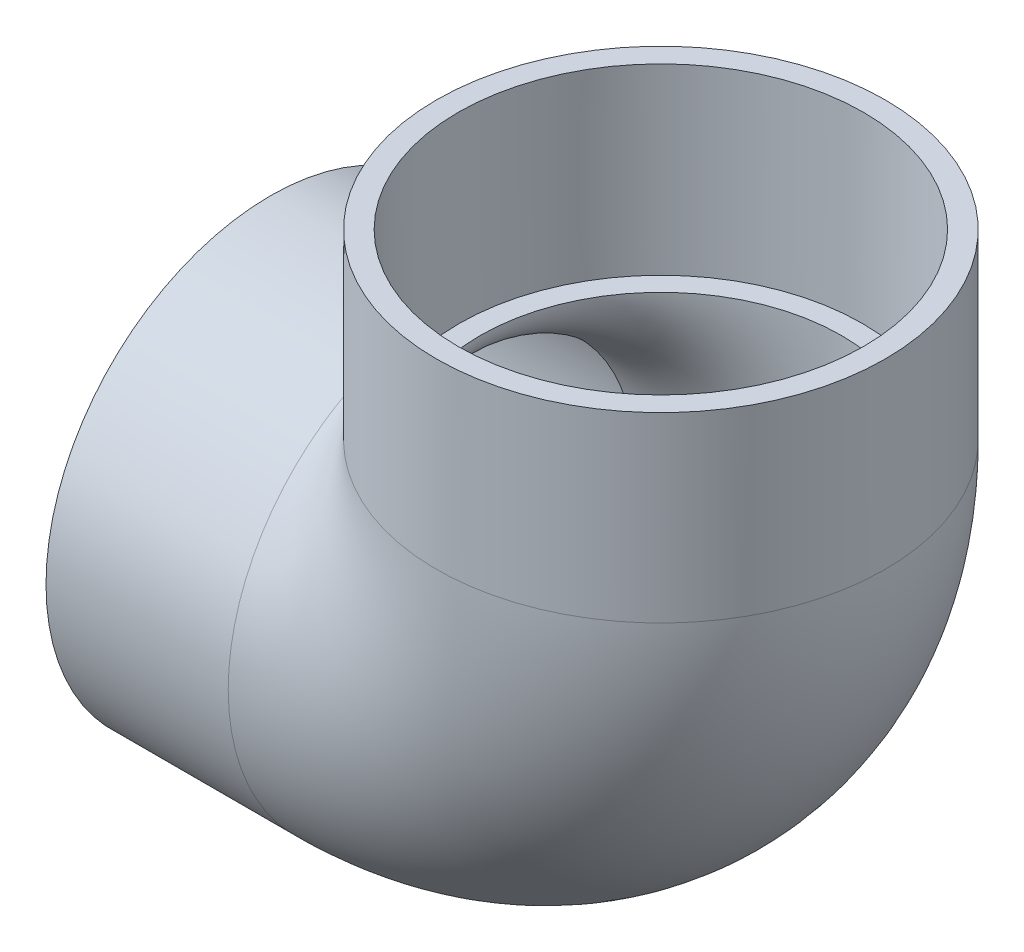
ISO-10303-21;
HEADER;
FILE_DESCRIPTION(('STEP AP214'),'2;1');
FILE_NAME('part.step','',(''),(''),'','','');
FILE_SCHEMA(('AUTOMOTIVE_DESIGN { 1 0 10303 214 1 1 1 1 }'));
ENDSEC;
DATA;
#1=APPLICATION_CONTEXT('core data for automotive mechanical design processes');
#2=APPLICATION_PROTOCOL_DEFINITION('international standard','automotive_design',2000,#1);
#3=PRODUCT_CONTEXT('',#1,'mechanical');
#4=PRODUCT('Part','Part','',(#3));
#5=PRODUCT_RELATED_PRODUCT_CATEGORY('part','',(#4));
#6=PRODUCT_DEFINITION_FORMATION('','',#4);
#7=PRODUCT_DEFINITION_CONTEXT('part definition',#1,'design');
#8=PRODUCT_DEFINITION('design','',#6,#7);
#9=PRODUCT_DEFINITION_SHAPE('','',#8);
#10=(LENGTH_UNIT() NAMED_UNIT(*) SI_UNIT(.MILLI.,.METRE.));
#11=(NAMED_UNIT(*) PLANE_ANGLE_UNIT() SI_UNIT($,.RADIAN.));
#12=(NAMED_UNIT(*) SI_UNIT($,.STERADIAN.) SOLID_ANGLE_UNIT());
#13=UNCERTAINTY_MEASURE_WITH_UNIT(LENGTH_MEASURE(1.E-05),#10,'distance_accuracy_value','');
#14=(GEOMETRIC_REPRESENTATION_CONTEXT(3) GLOBAL_UNCERTAINTY_ASSIGNED_CONTEXT((#13)) GLOBAL_UNIT_ASSIGNED_CONTEXT((#10,
#11,#12)) REPRESENTATION_CONTEXT('',''));
#15=CARTESIAN_POINT('',(0.,0.,0.));
#16=DIRECTION('',(0.,0.,1.));
#17=DIRECTION('',(1.,0.,0.));
#18=AXIS2_PLACEMENT_3D('',#15,#16,#17);
#19=CARTESIAN_POINT('',(-110.49,-63.4999999999999,-1.33226762955019E-12));
#20=DIRECTION('',(-1.,0.,0.));
#21=DIRECTION('',(0.,0.,1.));
#22=AXIS2_PLACEMENT_3D('',#19,#20,#21);
#23=PLANE('',#22);
#24=CARTESIAN_POINT('',(-110.49,0.,-1.33226762955019E-12));
#25=DIRECTION('',(-1.,0.,0.));
#26=DIRECTION('',(0.,0.,1.));
#27=AXIS2_PLACEMENT_3D('',#24,#25,#26);
#28=CIRCLE('',#27,63.5);
#29=CARTESIAN_POINT('',(-110.49,0.,63.4999999999987));
#30=VERTEX_POINT('',#29);
#31=EDGE_CURVE('E64',#30,#30,#28,.T.);
#32=ORIENTED_EDGE('',*,*,#31,.T.);
#33=EDGE_LOOP('',(#32));
#34=FACE_BOUND('',#33,.T.);
#35=CARTESIAN_POINT('',(-110.49,0.,-1.33226762955019E-12));
#36=DIRECTION('',(-1.,0.,0.));
#37=DIRECTION('',(0.,0.,1.));
#38=AXIS2_PLACEMENT_3D('',#35,#36,#37);
#39=CIRCLE('',#38,57.3786);
#40=CARTESIAN_POINT('',(-110.49,0.,57.3785999999987));
#41=VERTEX_POINT('',#40);
#42=EDGE_CURVE('E51',#41,#41,#39,.T.);
#43=ORIENTED_EDGE('',*,*,#42,.F.);
#44=EDGE_LOOP('',(#43));
#45=FACE_BOUND('',#44,.T.);
#46=ADVANCED_FACE('F44',(#34,#45),#23,.T.);
#47=CARTESIAN_POINT('',(-58.9279999999999,0.,-1.33226762955019E-12));
#48=DIRECTION('',(-1.,0.,0.));
#49=DIRECTION('',(0.,0.,1.));
#50=AXIS2_PLACEMENT_3D('',#47,#48,#49);
#51=CONICAL_SURFACE('',#50,57.0357,0.0066501482705858);
#52=ORIENTED_EDGE('',*,*,#42,.T.);
#53=EDGE_LOOP('',(#52));
#54=FACE_BOUND('',#53,.T.);
#55=CARTESIAN_POINT('',(-58.9279999999999,0.,-1.33226762955019E-12));
#56=DIRECTION('',(-1.,0.,0.));
#57=DIRECTION('',(0.,0.,1.));
#58=AXIS2_PLACEMENT_3D('',#55,#56,#57);
#59=CIRCLE('',#58,57.0357);
#60=CARTESIAN_POINT('',(-58.9279999999998,0.,57.0356999999987));
#61=VERTEX_POINT('',#60);
#62=EDGE_CURVE('E75',#61,#61,#59,.T.);
#63=ORIENTED_EDGE('',*,*,#62,.F.);
#64=EDGE_LOOP('',(#63));
#65=FACE_BOUND('',#64,.T.);
#66=ADVANCED_FACE('F84',(#54,#65),#51,.F.);
#67=CARTESIAN_POINT('',(-110.49,0.,-1.33226762955019E-12));
#68=DIRECTION('',(-1.,0.,0.));
#69=DIRECTION('',(0.,0.,1.));
#70=AXIS2_PLACEMENT_3D('',#67,#68,#69);
#71=CYLINDRICAL_SURFACE('',#70,63.5);
#72=CARTESIAN_POINT('',(0.,0.,0.));
#73=DIRECTION('',(-0.707106781186547,-0.707106781186547,0.));
#74=DIRECTION('',(-0.707106781186547,0.707106781186547,0.));
#75=AXIS2_PLACEMENT_3D('',#72,#73,#74);
#76=ELLIPSE('',#75,89.8025612106915,63.5);
#77=CARTESIAN_POINT('',(-58.9279999999999,58.9279999999999,-23.6588422371016));
#78=VERTEX_POINT('',#77);
#79=CARTESIAN_POINT('',(-58.9279999999999,58.9279999999999,23.6588422370989));
#80=VERTEX_POINT('',#79);
#81=EDGE_CURVE('E63',#78,#80,#76,.F.);
#82=ORIENTED_EDGE('',*,*,#81,.F.);
#83=CARTESIAN_POINT('',(-58.9279999999999,0.,-1.33226762955019E-12));
#84=DIRECTION('',(-1.,0.,0.));
#85=DIRECTION('',(0.,0.,1.));
#86=AXIS2_PLACEMENT_3D('',#83,#84,#85);
#87=CIRCLE('',#86,63.5);
#88=EDGE_CURVE('E70',#78,#80,#87,.T.);
#89=ORIENTED_EDGE('',*,*,#88,.T.);
#90=EDGE_LOOP('',(#82,#89));
#91=FACE_BOUND('',#90,.T.);
#92=ORIENTED_EDGE('',*,*,#31,.F.);
#93=EDGE_LOOP('',(#92));
#94=FACE_BOUND('',#93,.T.);
#95=ADVANCED_FACE('F68',(#91,#94),#71,.T.);
#96=CARTESIAN_POINT('',(-58.9279999999999,58.9279999999999,-1.33226762955019E-12));
#97=DIRECTION('',(0.,0.,-1.));
#98=DIRECTION('',(-1.,0.,0.));
#99=AXIS2_PLACEMENT_3D('',#96,#97,#98);
#100=TOROIDAL_SURFACE('',#99,58.928,51.1302);
#101=CARTESIAN_POINT('',(0.,58.9279999999999,0.));
#102=DIRECTION('',(0.,1.,0.));
#103=DIRECTION('',(0.,0.,-1.));
#104=AXIS2_PLACEMENT_3D('',#101,#102,#103);
#105=CIRCLE('',#104,51.1302);
#106=CARTESIAN_POINT('',(51.1302000000001,58.9279999999999,1.15597186995023E-12));
#107=VERTEX_POINT('',#106);
#108=EDGE_CURVE('E65',#107,#107,#105,.T.);
#109=CARTESIAN_POINT('',(-58.9279999999999,0.,-1.33226762955019E-12));
#110=DIRECTION('',(1.,0.,0.));
#111=DIRECTION('',(0.,0.,-1.));
#112=AXIS2_PLACEMENT_3D('',#109,#110,#111);
#113=CIRCLE('',#112,51.1302);
#114=CARTESIAN_POINT('',(-58.9279999999999,-51.1302000000001,-1.33226762955019E-12));
#115=VERTEX_POINT('',#114);
#116=EDGE_CURVE('E71',#115,#115,#113,.T.);
#117=CARTESIAN_POINT('',(-58.9279999999999,58.9279999999999,-1.33226762955019E-12));
#118=DIRECTION('',(0.,0.,-1.));
#119=DIRECTION('',(-1.,0.,0.));
#120=AXIS2_PLACEMENT_3D('',#117,#118,#119);
#121=CIRCLE('',#120,110.0582);
#122=EDGE_CURVE('',#107,#115,#121,.T.);
#123=ORIENTED_EDGE('',*,*,#108,.T.);
#124=ORIENTED_EDGE('',*,*,#116,.F.);
#125=ORIENTED_EDGE('',*,*,#122,.T.);
#126=ORIENTED_EDGE('',*,*,#122,.F.);
#127=EDGE_LOOP('',(#123,#125,#124,#126));
#128=FACE_BOUND('',#127,.T.);
#129=ADVANCED_FACE('F94',(#128),#100,.F.);
#130=CARTESIAN_POINT('',(-117.856,58.9279999999999,-1.45002942986139E-12));
#131=DIRECTION('',(0.,-1.,0.));
#132=DIRECTION('',(-1.,0.,0.));
#133=AXIS2_PLACEMENT_3D('',#130,#131,#132);
#134=CIRCLE('',#133,63.5);
#135=TRIMMED_CURVE('',#134,(PARAMETER_VALUE(-2.7598047993663)),
(PARAMETER_VALUE(2.7598047993663)),.T.,.PARAMETER.);
#136=CARTESIAN_POINT('',(-58.9279999999999,58.9279999999999,-1.33226762955019E-12));
#137=DIRECTION('',(0.,0.,-1.));
#138=AXIS1_PLACEMENT('',#136,#137);
#139=SURFACE_OF_REVOLUTION('',#135,#138);
#140=CARTESIAN_POINT('',(0.,58.9279999999999,0.));
#141=DIRECTION('',(0.,1.,0.));
#142=DIRECTION('',(0.,0.,-1.));
#143=AXIS2_PLACEMENT_3D('',#140,#141,#142);
#144=CIRCLE('',#143,63.5);
#145=EDGE_CURVE('E57',#80,#78,#144,.T.);
#146=ORIENTED_EDGE('',*,*,#145,.F.);
#147=ORIENTED_EDGE('',*,*,#88,.F.);
#148=EDGE_LOOP('',(#146,#147));
#149=FACE_BOUND('',#148,.T.);
#150=ADVANCED_FACE('F74',(#149),#139,.T.);
#151=CARTESIAN_POINT('',(0.,58.9279999999999,0.));
#152=DIRECTION('',(0.,1.,0.));
#153=DIRECTION('',(0.,0.,-1.));
#154=AXIS2_PLACEMENT_3D('',#151,#152,#153);
#155=PLANE('',#154);
#156=CARTESIAN_POINT('',(0.,58.9279999999999,0.));
#157=DIRECTION('',(0.,1.,0.));
#158=DIRECTION('',(-1.,0.,0.));
#159=AXIS2_PLACEMENT_3D('',#156,#157,#158);
#160=CIRCLE('',#159,57.0357);
#161=CARTESIAN_POINT('',(-57.0357,58.9279999999999,-1.13980225258103E-13));
#162=VERTEX_POINT('',#161);
#163=EDGE_CURVE('E13',#162,#162,#160,.F.);
#164=ORIENTED_EDGE('',*,*,#163,.F.);
#165=EDGE_LOOP('',(#164));
#166=FACE_BOUND('',#165,.T.);
#167=ORIENTED_EDGE('',*,*,#108,.F.);
#168=EDGE_LOOP('',(#167));
#169=FACE_BOUND('',#168,.T.);
#170=ADVANCED_FACE('F101',(#166,#169),#155,.T.);
#171=CARTESIAN_POINT('',(-58.9279999999999,0.,-1.33226762955019E-12));
#172=DIRECTION('',(1.,0.,0.));
#173=DIRECTION('',(0.,0.,-1.));
#174=AXIS2_PLACEMENT_3D('',#171,#172,#173);
#175=PLANE('',#174);
#176=ORIENTED_EDGE('',*,*,#62,.T.);
#177=EDGE_LOOP('',(#176));
#178=FACE_BOUND('',#177,.T.);
#179=ORIENTED_EDGE('',*,*,#116,.T.);
#180=EDGE_LOOP('',(#179));
#181=FACE_BOUND('',#180,.T.);
#182=ADVANCED_FACE('F104',(#178,#181),#175,.F.);
#183=CARTESIAN_POINT('',(63.4999999999999,110.490000000001,0.));
#184=DIRECTION('',(0.,1.,0.));
#185=DIRECTION('',(0.,0.,1.));
#186=AXIS2_PLACEMENT_3D('',#183,#184,#185);
#187=PLANE('',#186);
#188=CARTESIAN_POINT('',(0.,110.49,0.));
#189=DIRECTION('',(0.,-1.,0.));
#190=DIRECTION('',(0.,0.,-1.));
#191=AXIS2_PLACEMENT_3D('',#188,#189,#190);
#192=CIRCLE('',#191,57.3786);
#193=CARTESIAN_POINT('',(-1.14665477113363E-13,110.49,-57.3786));
#194=VERTEX_POINT('',#193);
#195=EDGE_CURVE('E128',#194,#194,#192,.T.);
#196=ORIENTED_EDGE('',*,*,#195,.T.);
#197=EDGE_LOOP('',(#196));
#198=FACE_BOUND('',#197,.T.);
#199=CARTESIAN_POINT('',(0.,110.49,0.));
#200=DIRECTION('',(0.,-1.,0.));
#201=DIRECTION('',(0.,0.,-1.));
#202=AXIS2_PLACEMENT_3D('',#199,#200,#201);
#203=CIRCLE('',#202,63.5);
#204=CARTESIAN_POINT('',(-1.26898491714655E-13,110.49,-63.5));
#205=VERTEX_POINT('',#204);
#206=EDGE_CURVE('E72',#205,#205,#203,.T.);
#207=ORIENTED_EDGE('',*,*,#206,.F.);
#208=EDGE_LOOP('',(#207));
#209=FACE_BOUND('',#208,.T.);
#210=ADVANCED_FACE('F111',(#198,#209),#187,.T.);
#211=CARTESIAN_POINT('',(0.,0.,0.));
#212=DIRECTION('',(0.,-1.,0.));
#213=DIRECTION('',(0.,0.,-1.));
#214=AXIS2_PLACEMENT_3D('',#211,#212,#213);
#215=CYLINDRICAL_SURFACE('',#214,63.5);
#216=ORIENTED_EDGE('',*,*,#206,.T.);
#217=EDGE_LOOP('',(#216));
#218=FACE_BOUND('',#217,.T.);
#219=ORIENTED_EDGE('',*,*,#145,.T.);
#220=ORIENTED_EDGE('',*,*,#81,.T.);
#221=EDGE_LOOP('',(#219,#220));
#222=FACE_BOUND('',#221,.T.);
#223=ADVANCED_FACE('F62',(#218,#222),#215,.T.);
#224=CARTESIAN_POINT('',(0.,110.49,0.));
#225=DIRECTION('',(0.,1.,0.));
#226=DIRECTION('',(0.,0.,1.));
#227=AXIS2_PLACEMENT_3D('',#224,#225,#226);
#228=CONICAL_SURFACE('',#227,57.3786,0.0066501482705858);
#229=ORIENTED_EDGE('',*,*,#163,.T.);
#230=EDGE_LOOP('',(#229));
#231=FACE_BOUND('',#230,.T.);
#232=ORIENTED_EDGE('',*,*,#195,.F.);
#233=EDGE_LOOP('',(#232));
#234=FACE_BOUND('',#233,.T.);
#235=ADVANCED_FACE('F118',(#231,#234),#228,.F.);
#236=CLOSED_SHELL('',(#46,#66,#95,#129,#150,#170,#182,#210,#223,#235));
#237=MANIFOLD_SOLID_BREP('B2',#236);
#238=ADVANCED_BREP_SHAPE_REPRESENTATION('',(#18,#237),#14);
#239=SHAPE_DEFINITION_REPRESENTATION(#9,#238);
ENDSEC;
END-ISO-10303-21;
